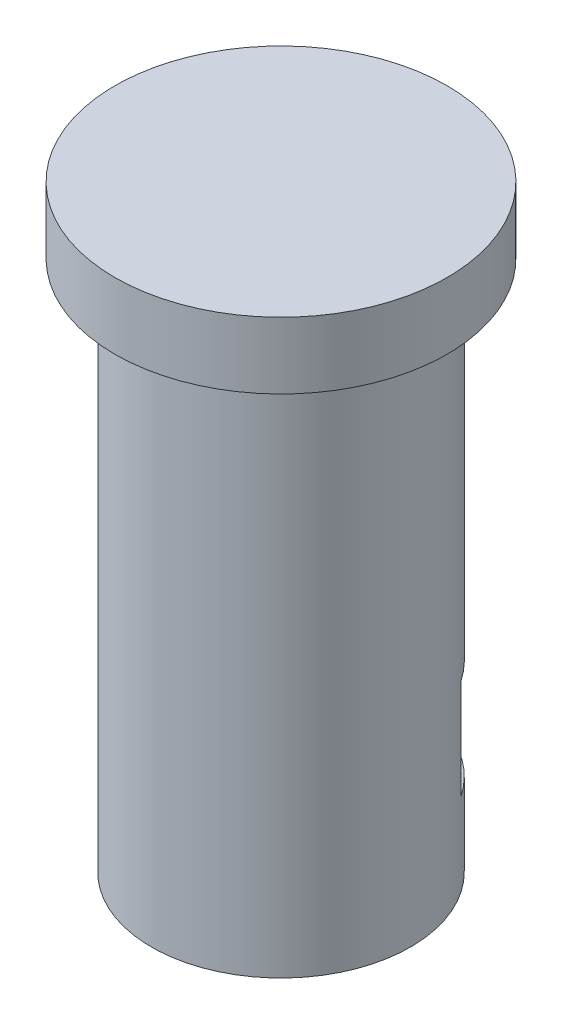
ISO-10303-21;
HEADER;
FILE_DESCRIPTION(('STEP AP214'),'2;1');
FILE_NAME('part.step','',(''),(''),'','','');
FILE_SCHEMA(('AUTOMOTIVE_DESIGN { 1 0 10303 214 1 1 1 1 }'));
ENDSEC;
DATA;
#1=APPLICATION_CONTEXT('core data for automotive mechanical design processes');
#2=APPLICATION_PROTOCOL_DEFINITION('international standard','automotive_design',2000,#1);
#3=PRODUCT_CONTEXT('',#1,'mechanical');
#4=PRODUCT('Part','Part','',(#3));
#5=PRODUCT_RELATED_PRODUCT_CATEGORY('part','',(#4));
#6=PRODUCT_DEFINITION_FORMATION('','',#4);
#7=PRODUCT_DEFINITION_CONTEXT('part definition',#1,'design');
#8=PRODUCT_DEFINITION('design','',#6,#7);
#9=PRODUCT_DEFINITION_SHAPE('','',#8);
#10=(LENGTH_UNIT() NAMED_UNIT(*) SI_UNIT(.MILLI.,.METRE.));
#11=(NAMED_UNIT(*) PLANE_ANGLE_UNIT() SI_UNIT($,.RADIAN.));
#12=(NAMED_UNIT(*) SI_UNIT($,.STERADIAN.) SOLID_ANGLE_UNIT());
#13=UNCERTAINTY_MEASURE_WITH_UNIT(LENGTH_MEASURE(1.E-05),#10,'distance_accuracy_value','');
#14=(GEOMETRIC_REPRESENTATION_CONTEXT(3) GLOBAL_UNCERTAINTY_ASSIGNED_CONTEXT((#13)) GLOBAL_UNIT_ASSIGNED_CONTEXT((#10,
#11,#12)) REPRESENTATION_CONTEXT('',''));
#15=CARTESIAN_POINT('',(0.,0.,0.));
#16=DIRECTION('',(0.,0.,1.));
#17=DIRECTION('',(1.,0.,0.));
#18=AXIS2_PLACEMENT_3D('',#15,#16,#17);
#19=CARTESIAN_POINT('',(-2.53312430606948,-10.5,1.4625));
#20=DIRECTION('',(0.866025403784439,0.,-0.5));
#21=DIRECTION('',(-0.5,0.,-0.866025403784439));
#22=AXIS2_PLACEMENT_3D('',#19,#20,#21);
#23=PLANE('',#22);
#24=DIRECTION('',(0.5,0.,0.866025403784439));
#25=VECTOR('',#24,1.);
#26=CARTESIAN_POINT('',(-2.53312430606948,-13.5,1.4625));
#27=LINE('',#26,#25);
#28=CARTESIAN_POINT('',(-3.3558484396647,-13.5,0.0374999999999997));
#29=VERTEX_POINT('',#28);
#30=CARTESIAN_POINT('',(-1.71040017247427,-13.5,2.8875));
#31=VERTEX_POINT('',#30);
#32=EDGE_CURVE('E125',#29,#31,#27,.T.);
#33=ORIENTED_EDGE('',*,*,#32,.F.);
#34=DIRECTION('',(0.,-1.,0.));
#35=VECTOR('',#34,1.);
#36=CARTESIAN_POINT('',(-3.3558484396647,-10.5,0.0375000000000002));
#37=LINE('',#36,#35);
#38=CARTESIAN_POINT('',(-3.3558484396647,-10.5,0.0374999999999997));
#39=VERTEX_POINT('',#38);
#40=EDGE_CURVE('E117',#39,#29,#37,.T.);
#41=ORIENTED_EDGE('',*,*,#40,.F.);
#42=DIRECTION('',(0.5,0.,0.866025403784439));
#43=VECTOR('',#42,1.);
#44=CARTESIAN_POINT('',(-2.53312430606948,-10.5,1.4625));
#45=LINE('',#44,#43);
#46=CARTESIAN_POINT('',(-1.71040017247427,-10.5,2.8875));
#47=VERTEX_POINT('',#46);
#48=EDGE_CURVE('E82',#39,#47,#45,.T.);
#49=ORIENTED_EDGE('',*,*,#48,.T.);
#50=DIRECTION('',(0.,-1.,0.));
#51=VECTOR('',#50,1.);
#52=CARTESIAN_POINT('',(-1.71040017247427,-10.5,2.8875));
#53=LINE('',#52,#51);
#54=EDGE_CURVE('E136',#47,#31,#53,.T.);
#55=ORIENTED_EDGE('',*,*,#54,.T.);
#56=EDGE_LOOP('',(#33,#41,#49,#55));
#57=FACE_BOUND('',#56,.T.);
#58=ADVANCED_FACE('F58',(#57),#23,.T.);
#59=CARTESIAN_POINT('',(0.,-10.5,2.8875));
#60=DIRECTION('',(0.,0.,-1.));
#61=DIRECTION('',(-1.,0.,0.));
#62=AXIS2_PLACEMENT_3D('',#59,#60,#61);
#63=PLANE('',#62);
#64=DIRECTION('',(1.,0.,0.));
#65=VECTOR('',#64,1.);
#66=CARTESIAN_POINT('',(0.,-13.5,2.8875));
#67=LINE('',#66,#65);
#68=CARTESIAN_POINT('',(1.5804963619066,-13.5,2.8875));
#69=VERTEX_POINT('',#68);
#70=EDGE_CURVE('E121',#31,#69,#67,.T.);
#71=ORIENTED_EDGE('',*,*,#70,.F.);
#72=ORIENTED_EDGE('',*,*,#54,.F.);
#73=DIRECTION('',(1.,0.,0.));
#74=VECTOR('',#73,1.);
#75=CARTESIAN_POINT('',(0.,-10.5,2.8875));
#76=LINE('',#75,#74);
#77=CARTESIAN_POINT('',(1.5804963619066,-10.5,2.8875));
#78=VERTEX_POINT('',#77);
#79=EDGE_CURVE('E175',#47,#78,#76,.T.);
#80=ORIENTED_EDGE('',*,*,#79,.T.);
#81=DIRECTION('',(0.,-1.,0.));
#82=VECTOR('',#81,1.);
#83=CARTESIAN_POINT('',(1.5804963619066,-10.5,2.8875));
#84=LINE('',#83,#82);
#85=EDGE_CURVE('E138',#78,#69,#84,.T.);
#86=ORIENTED_EDGE('',*,*,#85,.T.);
#87=EDGE_LOOP('',(#71,#72,#80,#86));
#88=FACE_BOUND('',#87,.T.);
#89=ADVANCED_FACE('F178',(#88),#63,.T.);
#90=CARTESIAN_POINT('',(2.43569644814374,-10.5,1.40625));
#91=DIRECTION('',(-0.866025403784439,0.,-0.5));
#92=DIRECTION('',(-0.5,0.,0.866025403784439));
#93=AXIS2_PLACEMENT_3D('',#90,#91,#92);
#94=PLANE('',#93);
#95=DIRECTION('',(0.5,0.,-0.866025403784439));
#96=VECTOR('',#95,1.);
#97=CARTESIAN_POINT('',(2.43569644814374,-13.5,1.40625));
#98=LINE('',#97,#96);
#99=CARTESIAN_POINT('',(3.22594462909703,-13.5,0.0374999999999991));
#100=VERTEX_POINT('',#99);
#101=EDGE_CURVE('E113',#69,#100,#98,.T.);
#102=ORIENTED_EDGE('',*,*,#101,.F.);
#103=ORIENTED_EDGE('',*,*,#85,.F.);
#104=DIRECTION('',(0.5,0.,-0.866025403784439));
#105=VECTOR('',#104,1.);
#106=CARTESIAN_POINT('',(2.43569644814374,-10.5,1.40625));
#107=LINE('',#106,#105);
#108=CARTESIAN_POINT('',(3.22594462909703,-10.5,0.0374999999999997));
#109=VERTEX_POINT('',#108);
#110=EDGE_CURVE('E115',#78,#109,#107,.T.);
#111=ORIENTED_EDGE('',*,*,#110,.T.);
#112=DIRECTION('',(0.,-1.,0.));
#113=VECTOR('',#112,1.);
#114=CARTESIAN_POINT('',(3.22594462909703,-10.5,0.0374999999999991));
#115=LINE('',#114,#113);
#116=EDGE_CURVE('E101',#109,#100,#115,.T.);
#117=ORIENTED_EDGE('',*,*,#116,.T.);
#118=EDGE_LOOP('',(#102,#103,#111,#117));
#119=FACE_BOUND('',#118,.T.);
#120=ADVANCED_FACE('F111',(#119),#94,.T.);
#121=CARTESIAN_POINT('',(0.,-13.5,0.));
#122=DIRECTION('',(0.,-1.,0.));
#123=DIRECTION('',(0.,0.,-1.));
#124=AXIS2_PLACEMENT_3D('',#121,#122,#123);
#125=PLANE('',#124);
#126=CARTESIAN_POINT('',(-0.0649519052838332,-13.5,0.0375000000000002));
#127=DIRECTION('',(0.,-1.,0.));
#128=DIRECTION('',(0.,0.,-1.));
#129=AXIS2_PLACEMENT_3D('',#126,#127,#128);
#130=CIRCLE('',#129,1.7);
#131=CARTESIAN_POINT('',(-0.0649519052838332,-13.5,-1.6625));
#132=VERTEX_POINT('',#131);
#133=EDGE_CURVE('E123',#132,#132,#130,.T.);
#134=ORIENTED_EDGE('',*,*,#133,.T.);
#135=EDGE_LOOP('',(#134));
#136=FACE_BOUND('',#135,.T.);
#137=ORIENTED_EDGE('',*,*,#101,.T.);
#138=DIRECTION('',(0.,0.,1.));
#139=VECTOR('',#138,1.);
#140=CARTESIAN_POINT('',(3.22594462909703,-13.5,-5.));
#141=LINE('',#140,#139);
#142=CARTESIAN_POINT('',(3.22594462909703,-13.5,-2.19163894152299));
#143=VERTEX_POINT('',#142);
#144=EDGE_CURVE('E73',#143,#100,#141,.T.);
#145=ORIENTED_EDGE('',*,*,#144,.F.);
#146=CARTESIAN_POINT('',(0.,-13.5,0.));
#147=DIRECTION('',(0.,-1.,0.));
#148=DIRECTION('',(0.,0.,-1.));
#149=AXIS2_PLACEMENT_3D('',#146,#147,#148);
#150=CIRCLE('',#149,3.9);
#151=CARTESIAN_POINT('',(-3.3558484396647,-13.5,-1.98702824589888));
#152=VERTEX_POINT('',#151);
#153=EDGE_CURVE('E146',#152,#143,#150,.T.);
#154=ORIENTED_EDGE('',*,*,#153,.F.);
#155=DIRECTION('',(0.,0.,1.));
#156=VECTOR('',#155,1.);
#157=CARTESIAN_POINT('',(-3.3558484396647,-13.5,-5.));
#158=LINE('',#157,#156);
#159=EDGE_CURVE('E107',#152,#29,#158,.T.);
#160=ORIENTED_EDGE('',*,*,#159,.T.);
#161=ORIENTED_EDGE('',*,*,#32,.T.);
#162=ORIENTED_EDGE('',*,*,#70,.T.);
#163=EDGE_LOOP('',(#137,#145,#154,#160,#161,#162));
#164=FACE_BOUND('',#163,.T.);
#165=ADVANCED_FACE('F119',(#136,#164),#125,.F.);
#166=CARTESIAN_POINT('',(0.,-10.5,0.));
#167=DIRECTION('',(0.,-1.,0.));
#168=DIRECTION('',(0.,0.,-1.));
#169=AXIS2_PLACEMENT_3D('',#166,#167,#168);
#170=PLANE('',#169);
#171=DIRECTION('',(0.,0.,1.));
#172=VECTOR('',#171,1.);
#173=CARTESIAN_POINT('',(3.22594462909703,-10.5,-5.));
#174=LINE('',#173,#172);
#175=CARTESIAN_POINT('',(3.22594462909703,-10.5,-2.19163894152299));
#176=VERTEX_POINT('',#175);
#177=EDGE_CURVE('E106',#176,#109,#174,.T.);
#178=ORIENTED_EDGE('',*,*,#177,.T.);
#179=ORIENTED_EDGE('',*,*,#110,.F.);
#180=ORIENTED_EDGE('',*,*,#79,.F.);
#181=ORIENTED_EDGE('',*,*,#48,.F.);
#182=DIRECTION('',(0.,0.,1.));
#183=VECTOR('',#182,1.);
#184=CARTESIAN_POINT('',(-3.3558484396647,-10.5,-5.));
#185=LINE('',#184,#183);
#186=CARTESIAN_POINT('',(-3.3558484396647,-10.5,-1.98702824589888));
#187=VERTEX_POINT('',#186);
#188=EDGE_CURVE('E166',#187,#39,#185,.T.);
#189=ORIENTED_EDGE('',*,*,#188,.F.);
#190=CARTESIAN_POINT('',(0.,-10.5,0.));
#191=DIRECTION('',(0.,1.,0.));
#192=DIRECTION('',(0.,0.,1.));
#193=AXIS2_PLACEMENT_3D('',#190,#191,#192);
#194=CIRCLE('',#193,3.9);
#195=EDGE_CURVE('E66',#176,#187,#194,.T.);
#196=ORIENTED_EDGE('',*,*,#195,.F.);
#197=EDGE_LOOP('',(#178,#179,#180,#181,#189,#196));
#198=FACE_BOUND('',#197,.T.);
#199=ADVANCED_FACE('F164',(#198),#170,.T.);
#200=CARTESIAN_POINT('',(-0.0649519052838332,-16.,0.0375000000000002));
#201=DIRECTION('',(0.,1.,0.));
#202=DIRECTION('',(0.,0.,1.));
#203=AXIS2_PLACEMENT_3D('',#200,#201,#202);
#204=CYLINDRICAL_SURFACE('',#203,1.7);
#205=CARTESIAN_POINT('',(-0.0649519052838332,-16.,0.0375000000000002));
#206=DIRECTION('',(0.,-1.,0.));
#207=DIRECTION('',(0.,0.,-1.));
#208=AXIS2_PLACEMENT_3D('',#205,#206,#207);
#209=CIRCLE('',#208,1.7);
#210=CARTESIAN_POINT('',(-0.0649519052838332,-16.,-1.6625));
#211=VERTEX_POINT('',#210);
#212=EDGE_CURVE('E128',#211,#211,#209,.F.);
#213=ORIENTED_EDGE('',*,*,#212,.F.);
#214=EDGE_LOOP('',(#213));
#215=FACE_BOUND('',#214,.T.);
#216=ORIENTED_EDGE('',*,*,#133,.F.);
#217=EDGE_LOOP('',(#216));
#218=FACE_BOUND('',#217,.T.);
#219=ADVANCED_FACE('F219',(#215,#218),#204,.F.);
#220=CARTESIAN_POINT('',(0.,2.,0.));
#221=DIRECTION('',(0.,-1.,0.));
#222=DIRECTION('',(0.,0.,-1.));
#223=AXIS2_PLACEMENT_3D('',#220,#221,#222);
#224=CYLINDRICAL_SURFACE('',#223,5.);
#225=CARTESIAN_POINT('',(0.,2.,0.));
#226=DIRECTION('',(0.,1.,0.));
#227=DIRECTION('',(0.,0.,1.));
#228=AXIS2_PLACEMENT_3D('',#225,#226,#227);
#229=CIRCLE('',#228,5.);
#230=CARTESIAN_POINT('',(0.,2.,5.));
#231=VERTEX_POINT('',#230);
#232=EDGE_CURVE('E147',#231,#231,#229,.T.);
#233=ORIENTED_EDGE('',*,*,#232,.F.);
#234=EDGE_LOOP('',(#233));
#235=FACE_BOUND('',#234,.T.);
#236=CARTESIAN_POINT('',(0.,0.,0.));
#237=DIRECTION('',(0.,1.,0.));
#238=DIRECTION('',(0.,0.,1.));
#239=AXIS2_PLACEMENT_3D('',#236,#237,#238);
#240=CIRCLE('',#239,5.);
#241=CARTESIAN_POINT('',(0.,0.,5.));
#242=VERTEX_POINT('',#241);
#243=EDGE_CURVE('E142',#242,#242,#240,.T.);
#244=ORIENTED_EDGE('',*,*,#243,.T.);
#245=EDGE_LOOP('',(#244));
#246=FACE_BOUND('',#245,.T.);
#247=ADVANCED_FACE('F60',(#235,#246),#224,.T.);
#248=CARTESIAN_POINT('',(0.,2.,0.));
#249=DIRECTION('',(0.,1.,0.));
#250=DIRECTION('',(0.,0.,1.));
#251=AXIS2_PLACEMENT_3D('',#248,#249,#250);
#252=PLANE('',#251);
#253=ORIENTED_EDGE('',*,*,#232,.T.);
#254=EDGE_LOOP('',(#253));
#255=FACE_BOUND('',#254,.T.);
#256=ADVANCED_FACE('F207',(#255),#252,.T.);
#257=CARTESIAN_POINT('',(0.,0.,0.));
#258=DIRECTION('',(0.,1.,0.));
#259=DIRECTION('',(0.,0.,1.));
#260=AXIS2_PLACEMENT_3D('',#257,#258,#259);
#261=PLANE('',#260);
#262=CARTESIAN_POINT('',(0.,0.,0.));
#263=DIRECTION('',(0.,-1.,0.));
#264=DIRECTION('',(0.,0.,-1.));
#265=AXIS2_PLACEMENT_3D('',#262,#263,#264);
#266=CIRCLE('',#265,3.9);
#267=CARTESIAN_POINT('',(0.,0.,-3.9));
#268=VERTEX_POINT('',#267);
#269=EDGE_CURVE('E143',#268,#268,#266,.T.);
#270=ORIENTED_EDGE('',*,*,#269,.F.);
#271=EDGE_LOOP('',(#270));
#272=FACE_BOUND('',#271,.T.);
#273=ORIENTED_EDGE('',*,*,#243,.F.);
#274=EDGE_LOOP('',(#273));
#275=FACE_BOUND('',#274,.T.);
#276=ADVANCED_FACE('F206',(#272,#275),#261,.F.);
#277=CARTESIAN_POINT('',(0.,-16.,0.));
#278=DIRECTION('',(0.,1.,0.));
#279=DIRECTION('',(0.,0.,1.));
#280=AXIS2_PLACEMENT_3D('',#277,#278,#279);
#281=CYLINDRICAL_SURFACE('',#280,3.9);
#282=ORIENTED_EDGE('',*,*,#195,.T.);
#283=DIRECTION('',(0.,1.,0.));
#284=VECTOR('',#283,1.);
#285=CARTESIAN_POINT('',(-3.3558484396647,-16.,-1.98702824589888));
#286=LINE('',#285,#284);
#287=EDGE_CURVE('E12',#187,#152,#286,.F.);
#288=ORIENTED_EDGE('',*,*,#287,.T.);
#289=ORIENTED_EDGE('',*,*,#153,.T.);
#290=DIRECTION('',(0.,1.,0.));
#291=VECTOR('',#290,1.);
#292=CARTESIAN_POINT('',(3.22594462909703,-16.,-2.19163894152299));
#293=LINE('',#292,#291);
#294=EDGE_CURVE('E104',#143,#176,#293,.T.);
#295=ORIENTED_EDGE('',*,*,#294,.T.);
#296=EDGE_LOOP('',(#282,#288,#289,#295));
#297=FACE_BOUND('',#296,.T.);
#298=CARTESIAN_POINT('',(0.,-16.,0.));
#299=DIRECTION('',(0.,-1.,0.));
#300=DIRECTION('',(0.,0.,-1.));
#301=AXIS2_PLACEMENT_3D('',#298,#299,#300);
#302=CIRCLE('',#301,3.9);
#303=CARTESIAN_POINT('',(0.,-16.,-3.9));
#304=VERTEX_POINT('',#303);
#305=EDGE_CURVE('E116',#304,#304,#302,.T.);
#306=ORIENTED_EDGE('',*,*,#305,.F.);
#307=EDGE_LOOP('',(#306));
#308=FACE_BOUND('',#307,.T.);
#309=ORIENTED_EDGE('',*,*,#269,.T.);
#310=EDGE_LOOP('',(#309));
#311=FACE_BOUND('',#310,.T.);
#312=ADVANCED_FACE('F156',(#297,#308,#311),#281,.T.);
#313=CARTESIAN_POINT('',(0.,-16.,0.));
#314=DIRECTION('',(0.,-1.,0.));
#315=DIRECTION('',(0.,0.,-1.));
#316=AXIS2_PLACEMENT_3D('',#313,#314,#315);
#317=PLANE('',#316);
#318=ORIENTED_EDGE('',*,*,#212,.T.);
#319=EDGE_LOOP('',(#318));
#320=FACE_BOUND('',#319,.T.);
#321=ORIENTED_EDGE('',*,*,#305,.T.);
#322=EDGE_LOOP('',(#321));
#323=FACE_BOUND('',#322,.T.);
#324=ADVANCED_FACE('F200',(#320,#323),#317,.T.);
#325=CARTESIAN_POINT('',(-3.3558484396647,-13.5,-5.));
#326=DIRECTION('',(-1.,0.,0.));
#327=DIRECTION('',(0.,0.,1.));
#328=AXIS2_PLACEMENT_3D('',#325,#326,#327);
#329=PLANE('',#328);
#330=ORIENTED_EDGE('',*,*,#188,.T.);
#331=ORIENTED_EDGE('',*,*,#40,.T.);
#332=ORIENTED_EDGE('',*,*,#159,.F.);
#333=ORIENTED_EDGE('',*,*,#287,.F.);
#334=EDGE_LOOP('',(#330,#331,#332,#333));
#335=FACE_BOUND('',#334,.T.);
#336=ADVANCED_FACE('F188',(#335),#329,.F.);
#337=CARTESIAN_POINT('',(3.22594462909703,-13.5,-5.));
#338=DIRECTION('',(1.,0.,0.));
#339=DIRECTION('',(0.,0.,-1.));
#340=AXIS2_PLACEMENT_3D('',#337,#338,#339);
#341=PLANE('',#340);
#342=ORIENTED_EDGE('',*,*,#144,.T.);
#343=ORIENTED_EDGE('',*,*,#116,.F.);
#344=ORIENTED_EDGE('',*,*,#177,.F.);
#345=ORIENTED_EDGE('',*,*,#294,.F.);
#346=EDGE_LOOP('',(#342,#343,#344,#345));
#347=FACE_BOUND('',#346,.T.);
#348=ADVANCED_FACE('F98',(#347),#341,.F.);
#349=CLOSED_SHELL('',(#58,#89,#120,#165,#199,#219,#247,#256,#276,#312,#324,#336,#348));
#350=MANIFOLD_SOLID_BREP('B2',#349);
#351=ADVANCED_BREP_SHAPE_REPRESENTATION('',(#18,#350),#14);
#352=SHAPE_DEFINITION_REPRESENTATION(#9,#351);
ENDSEC;
END-ISO-10303-21;
